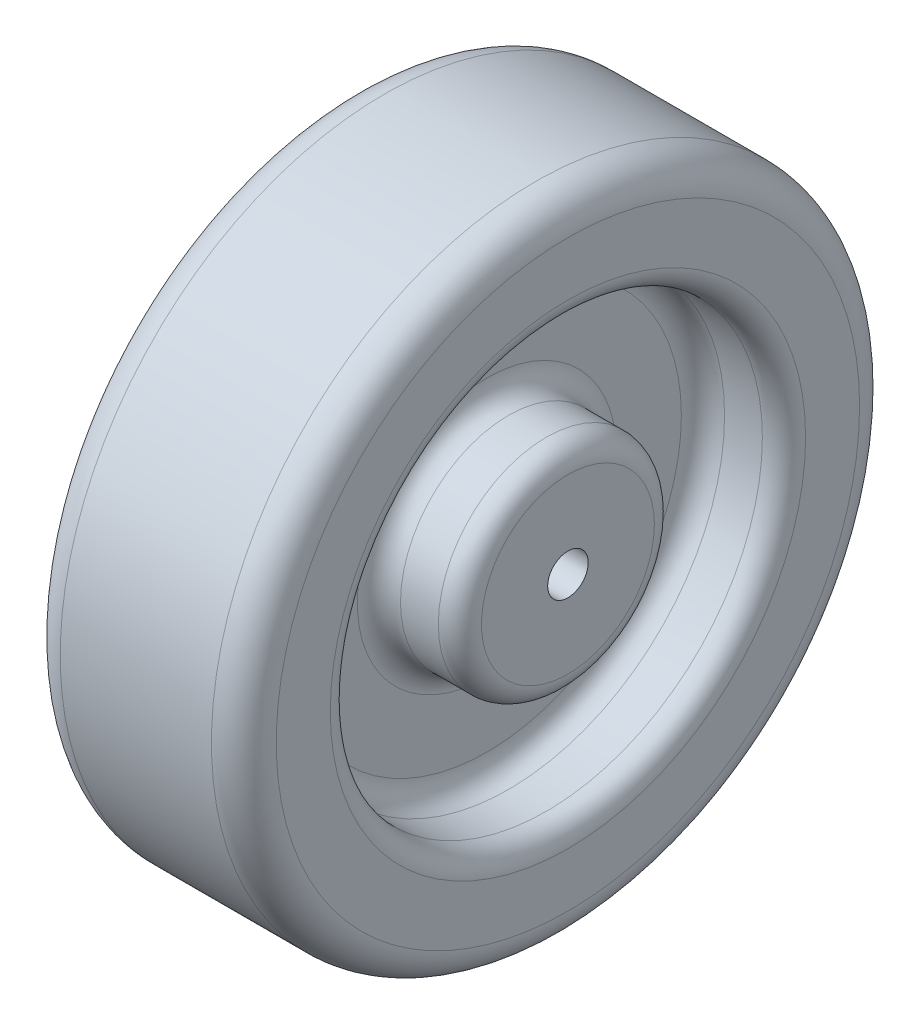
ISO-10303-21;
HEADER;
FILE_DESCRIPTION(('STEP AP214'),'2;1');
FILE_NAME('part.step','',(''),(''),'','','');
FILE_SCHEMA(('AUTOMOTIVE_DESIGN { 1 0 10303 214 1 1 1 1 }'));
ENDSEC;
DATA;
#1=APPLICATION_CONTEXT('core data for automotive mechanical design processes');
#2=APPLICATION_PROTOCOL_DEFINITION('international standard','automotive_design',2000,#1);
#3=PRODUCT_CONTEXT('',#1,'mechanical');
#4=PRODUCT('Part','Part','',(#3));
#5=PRODUCT_RELATED_PRODUCT_CATEGORY('part','',(#4));
#6=PRODUCT_DEFINITION_FORMATION('','',#4);
#7=PRODUCT_DEFINITION_CONTEXT('part definition',#1,'design');
#8=PRODUCT_DEFINITION('design','',#6,#7);
#9=PRODUCT_DEFINITION_SHAPE('','',#8);
#10=(LENGTH_UNIT() NAMED_UNIT(*) SI_UNIT(.MILLI.,.METRE.));
#11=(NAMED_UNIT(*) PLANE_ANGLE_UNIT() SI_UNIT($,.RADIAN.));
#12=(NAMED_UNIT(*) SI_UNIT($,.STERADIAN.) SOLID_ANGLE_UNIT());
#13=UNCERTAINTY_MEASURE_WITH_UNIT(LENGTH_MEASURE(1.E-05),#10,'distance_accuracy_value','');
#14=(GEOMETRIC_REPRESENTATION_CONTEXT(3) GLOBAL_UNCERTAINTY_ASSIGNED_CONTEXT((#13)) GLOBAL_UNIT_ASSIGNED_CONTEXT((#10,
#11,#12)) REPRESENTATION_CONTEXT('',''));
#15=CARTESIAN_POINT('',(0.,0.,0.));
#16=DIRECTION('',(0.,0.,1.));
#17=DIRECTION('',(1.,0.,0.));
#18=AXIS2_PLACEMENT_3D('',#15,#16,#17);
#19=CARTESIAN_POINT('',(50.8,0.,0.));
#20=DIRECTION('',(-1.,0.,0.));
#21=DIRECTION('',(0.,0.,1.));
#22=AXIS2_PLACEMENT_3D('',#19,#20,#21);
#23=CYLINDRICAL_SURFACE('',#22,76.2);
#24=CARTESIAN_POINT('',(7.62,0.,0.));
#25=DIRECTION('',(1.,0.,0.));
#26=DIRECTION('',(0.,0.,-1.));
#27=AXIS2_PLACEMENT_3D('',#24,#25,#26);
#28=CIRCLE('',#27,76.2);
#29=CARTESIAN_POINT('',(7.62,0.,-76.2));
#30=VERTEX_POINT('',#29);
#31=EDGE_CURVE('E95',#30,#30,#28,.T.);
#32=ORIENTED_EDGE('',*,*,#31,.T.);
#33=EDGE_LOOP('',(#32));
#34=FACE_BOUND('',#33,.T.);
#35=CARTESIAN_POINT('',(43.18,0.,0.));
#36=DIRECTION('',(1.,0.,0.));
#37=DIRECTION('',(0.,0.,-1.));
#38=AXIS2_PLACEMENT_3D('',#35,#36,#37);
#39=CIRCLE('',#38,76.2);
#40=CARTESIAN_POINT('',(43.18,0.,-76.2));
#41=VERTEX_POINT('',#40);
#42=EDGE_CURVE('E98',#41,#41,#39,.F.);
#43=ORIENTED_EDGE('',*,*,#42,.T.);
#44=EDGE_LOOP('',(#43));
#45=FACE_BOUND('',#44,.T.);
#46=ADVANCED_FACE('F33',(#34,#45),#23,.T.);
#47=CARTESIAN_POINT('',(50.8,0.,0.));
#48=DIRECTION('',(1.,0.,0.));
#49=DIRECTION('',(0.,0.,-1.));
#50=AXIS2_PLACEMENT_3D('',#47,#48,#49);
#51=PLANE('',#50);
#52=CARTESIAN_POINT('',(50.8,0.,0.));
#53=DIRECTION('',(1.,0.,0.));
#54=DIRECTION('',(0.,0.,-1.));
#55=AXIS2_PLACEMENT_3D('',#52,#53,#54);
#56=CIRCLE('',#55,55.88);
#57=CARTESIAN_POINT('',(50.8,0.,-55.88));
#58=VERTEX_POINT('',#57);
#59=EDGE_CURVE('E40',#58,#58,#56,.F.);
#60=ORIENTED_EDGE('',*,*,#59,.T.);
#61=EDGE_LOOP('',(#60));
#62=FACE_BOUND('',#61,.T.);
#63=CARTESIAN_POINT('',(50.8,0.,0.));
#64=DIRECTION('',(1.,0.,0.));
#65=DIRECTION('',(0.,0.,-1.));
#66=AXIS2_PLACEMENT_3D('',#63,#64,#65);
#67=CIRCLE('',#66,68.58);
#68=CARTESIAN_POINT('',(50.8,0.,-68.58));
#69=VERTEX_POINT('',#68);
#70=EDGE_CURVE('E89',#69,#69,#67,.T.);
#71=ORIENTED_EDGE('',*,*,#70,.T.);
#72=EDGE_LOOP('',(#71));
#73=FACE_BOUND('',#72,.T.);
#74=ADVANCED_FACE('F133',(#62,#73),#51,.T.);
#75=CARTESIAN_POINT('',(0.,0.,0.));
#76=DIRECTION('',(1.,0.,0.));
#77=DIRECTION('',(0.,0.,-1.));
#78=AXIS2_PLACEMENT_3D('',#75,#76,#77);
#79=PLANE('',#78);
#80=CARTESIAN_POINT('',(0.,0.,0.));
#81=DIRECTION('',(1.,0.,0.));
#82=DIRECTION('',(0.,0.,-1.));
#83=AXIS2_PLACEMENT_3D('',#80,#81,#82);
#84=CIRCLE('',#83,55.88);
#85=CARTESIAN_POINT('',(0.,0.,-55.88));
#86=VERTEX_POINT('',#85);
#87=EDGE_CURVE('E68',#86,#86,#84,.T.);
#88=ORIENTED_EDGE('',*,*,#87,.T.);
#89=EDGE_LOOP('',(#88));
#90=FACE_BOUND('',#89,.T.);
#91=CARTESIAN_POINT('',(0.,0.,0.));
#92=DIRECTION('',(1.,0.,0.));
#93=DIRECTION('',(0.,0.,-1.));
#94=AXIS2_PLACEMENT_3D('',#91,#92,#93);
#95=CIRCLE('',#94,68.58);
#96=CARTESIAN_POINT('',(0.,0.,-68.58));
#97=VERTEX_POINT('',#96);
#98=EDGE_CURVE('E92',#97,#97,#95,.F.);
#99=ORIENTED_EDGE('',*,*,#98,.T.);
#100=EDGE_LOOP('',(#99));
#101=FACE_BOUND('',#100,.T.);
#102=ADVANCED_FACE('F122',(#90,#101),#79,.F.);
#103=CARTESIAN_POINT('',(31.75,0.,0.));
#104=DIRECTION('',(1.,0.,0.));
#105=DIRECTION('',(0.,0.,-1.));
#106=AXIS2_PLACEMENT_3D('',#103,#104,#105);
#107=CYLINDRICAL_SURFACE('',#106,50.8);
#108=CARTESIAN_POINT('',(36.83,0.,0.));
#109=DIRECTION('',(1.,0.,0.));
#110=DIRECTION('',(0.,0.,-1.));
#111=AXIS2_PLACEMENT_3D('',#108,#109,#110);
#112=CIRCLE('',#111,50.8);
#113=CARTESIAN_POINT('',(36.83,0.,-50.8));
#114=VERTEX_POINT('',#113);
#115=EDGE_CURVE('E44',#114,#114,#112,.F.);
#116=ORIENTED_EDGE('',*,*,#115,.T.);
#117=EDGE_LOOP('',(#116));
#118=FACE_BOUND('',#117,.T.);
#119=CARTESIAN_POINT('',(45.72,0.,0.));
#120=DIRECTION('',(1.,0.,0.));
#121=DIRECTION('',(0.,0.,-1.));
#122=AXIS2_PLACEMENT_3D('',#119,#120,#121);
#123=CIRCLE('',#122,50.8);
#124=CARTESIAN_POINT('',(45.72,0.,-50.8));
#125=VERTEX_POINT('',#124);
#126=EDGE_CURVE('E48',#125,#125,#123,.T.);
#127=ORIENTED_EDGE('',*,*,#126,.T.);
#128=EDGE_LOOP('',(#127));
#129=FACE_BOUND('',#128,.T.);
#130=ADVANCED_FACE('F132',(#118,#129),#107,.F.);
#131=CARTESIAN_POINT('',(31.75,0.,0.));
#132=DIRECTION('',(1.,0.,0.));
#133=DIRECTION('',(0.,0.,-1.));
#134=AXIS2_PLACEMENT_3D('',#131,#132,#133);
#135=PLANE('',#134);
#136=CARTESIAN_POINT('',(31.75,0.,0.));
#137=DIRECTION('',(1.,0.,0.));
#138=DIRECTION('',(0.,0.,-1.));
#139=AXIS2_PLACEMENT_3D('',#136,#137,#138);
#140=CIRCLE('',#139,30.48);
#141=CARTESIAN_POINT('',(31.75,0.,-30.48));
#142=VERTEX_POINT('',#141);
#143=EDGE_CURVE('E53',#142,#142,#140,.F.);
#144=ORIENTED_EDGE('',*,*,#143,.T.);
#145=EDGE_LOOP('',(#144));
#146=FACE_BOUND('',#145,.T.);
#147=CARTESIAN_POINT('',(31.75,0.,0.));
#148=DIRECTION('',(1.,0.,0.));
#149=DIRECTION('',(0.,0.,-1.));
#150=AXIS2_PLACEMENT_3D('',#147,#148,#149);
#151=CIRCLE('',#150,45.72);
#152=CARTESIAN_POINT('',(31.75,0.,-45.72));
#153=VERTEX_POINT('',#152);
#154=EDGE_CURVE('E56',#153,#153,#151,.T.);
#155=ORIENTED_EDGE('',*,*,#154,.T.);
#156=EDGE_LOOP('',(#155));
#157=FACE_BOUND('',#156,.T.);
#158=ADVANCED_FACE('F183',(#146,#157),#135,.T.);
#159=CARTESIAN_POINT('',(31.75,0.,0.));
#160=DIRECTION('',(1.,0.,0.));
#161=DIRECTION('',(0.,0.,-1.));
#162=AXIS2_PLACEMENT_3D('',#159,#160,#161);
#163=CYLINDRICAL_SURFACE('',#162,25.4);
#164=CARTESIAN_POINT('',(36.83,0.,0.));
#165=DIRECTION('',(1.,0.,0.));
#166=DIRECTION('',(0.,0.,-1.));
#167=AXIS2_PLACEMENT_3D('',#164,#165,#166);
#168=CIRCLE('',#167,25.4);
#169=CARTESIAN_POINT('',(36.83,0.,-25.4));
#170=VERTEX_POINT('',#169);
#171=EDGE_CURVE('E59',#170,#170,#168,.T.);
#172=ORIENTED_EDGE('',*,*,#171,.T.);
#173=EDGE_LOOP('',(#172));
#174=FACE_BOUND('',#173,.T.);
#175=CARTESIAN_POINT('',(45.72,0.,0.));
#176=DIRECTION('',(1.,0.,0.));
#177=DIRECTION('',(0.,0.,-1.));
#178=AXIS2_PLACEMENT_3D('',#175,#176,#177);
#179=CIRCLE('',#178,25.4);
#180=CARTESIAN_POINT('',(45.72,0.,-25.4));
#181=VERTEX_POINT('',#180);
#182=EDGE_CURVE('E62',#181,#181,#179,.F.);
#183=ORIENTED_EDGE('',*,*,#182,.T.);
#184=EDGE_LOOP('',(#183));
#185=FACE_BOUND('',#184,.T.);
#186=ADVANCED_FACE('F189',(#174,#185),#163,.T.);
#187=CARTESIAN_POINT('',(50.8,0.,0.));
#188=DIRECTION('',(1.,0.,0.));
#189=DIRECTION('',(0.,0.,-1.));
#190=AXIS2_PLACEMENT_3D('',#187,#188,#189);
#191=CIRCLE('',#190,20.32);
#192=CARTESIAN_POINT('',(50.8,0.,-20.32));
#193=VERTEX_POINT('',#192);
#194=EDGE_CURVE('E10',#193,#193,#191,.T.);
#195=ORIENTED_EDGE('',*,*,#194,.T.);
#196=EDGE_LOOP('',(#195));
#197=FACE_BOUND('',#196,.T.);
#198=CARTESIAN_POINT('',(50.8,0.,0.));
#199=DIRECTION('',(-1.,0.,0.));
#200=DIRECTION('',(0.,0.,1.));
#201=AXIS2_PLACEMENT_3D('',#198,#199,#200);
#202=CIRCLE('',#201,4.7625);
#203=CARTESIAN_POINT('',(50.8,0.,4.7625));
#204=VERTEX_POINT('',#203);
#205=EDGE_CURVE('E101',#204,#204,#202,.T.);
#206=ORIENTED_EDGE('',*,*,#205,.T.);
#207=EDGE_LOOP('',(#206));
#208=FACE_BOUND('',#207,.T.);
#209=ADVANCED_FACE('F108',(#197,#208),#51,.T.);
#210=CARTESIAN_POINT('',(19.05,0.,0.));
#211=DIRECTION('',(-1.,0.,0.));
#212=DIRECTION('',(0.,0.,1.));
#213=AXIS2_PLACEMENT_3D('',#210,#211,#212);
#214=CYLINDRICAL_SURFACE('',#213,50.8);
#215=CARTESIAN_POINT('',(5.08,0.,0.));
#216=DIRECTION('',(1.,0.,0.));
#217=DIRECTION('',(0.,0.,-1.));
#218=AXIS2_PLACEMENT_3D('',#215,#216,#217);
#219=CIRCLE('',#218,50.8);
#220=CARTESIAN_POINT('',(5.08,0.,-50.8));
#221=VERTEX_POINT('',#220);
#222=EDGE_CURVE('E71',#221,#221,#219,.F.);
#223=ORIENTED_EDGE('',*,*,#222,.T.);
#224=EDGE_LOOP('',(#223));
#225=FACE_BOUND('',#224,.T.);
#226=CARTESIAN_POINT('',(13.97,0.,0.));
#227=DIRECTION('',(-1.,0.,0.));
#228=DIRECTION('',(0.,0.,1.));
#229=AXIS2_PLACEMENT_3D('',#226,#227,#228);
#230=CIRCLE('',#229,50.8);
#231=CARTESIAN_POINT('',(13.97,0.,50.8));
#232=VERTEX_POINT('',#231);
#233=EDGE_CURVE('E74',#232,#232,#230,.F.);
#234=ORIENTED_EDGE('',*,*,#233,.T.);
#235=EDGE_LOOP('',(#234));
#236=FACE_BOUND('',#235,.T.);
#237=ADVANCED_FACE('F196',(#225,#236),#214,.F.);
#238=CARTESIAN_POINT('',(19.05,0.,0.));
#239=DIRECTION('',(-1.,0.,0.));
#240=DIRECTION('',(0.,0.,1.));
#241=AXIS2_PLACEMENT_3D('',#238,#239,#240);
#242=PLANE('',#241);
#243=CARTESIAN_POINT('',(19.05,0.,0.));
#244=DIRECTION('',(-1.,0.,0.));
#245=DIRECTION('',(0.,0.,1.));
#246=AXIS2_PLACEMENT_3D('',#243,#244,#245);
#247=CIRCLE('',#246,30.48);
#248=CARTESIAN_POINT('',(19.05,0.,30.48));
#249=VERTEX_POINT('',#248);
#250=EDGE_CURVE('E77',#249,#249,#247,.F.);
#251=ORIENTED_EDGE('',*,*,#250,.T.);
#252=EDGE_LOOP('',(#251));
#253=FACE_BOUND('',#252,.T.);
#254=CARTESIAN_POINT('',(19.05,0.,0.));
#255=DIRECTION('',(-1.,0.,0.));
#256=DIRECTION('',(0.,0.,1.));
#257=AXIS2_PLACEMENT_3D('',#254,#255,#256);
#258=CIRCLE('',#257,45.72);
#259=CARTESIAN_POINT('',(19.05,0.,45.72));
#260=VERTEX_POINT('',#259);
#261=EDGE_CURVE('E80',#260,#260,#258,.T.);
#262=ORIENTED_EDGE('',*,*,#261,.T.);
#263=EDGE_LOOP('',(#262));
#264=FACE_BOUND('',#263,.T.);
#265=ADVANCED_FACE('F126',(#253,#264),#242,.T.);
#266=CARTESIAN_POINT('',(19.05,0.,0.));
#267=DIRECTION('',(-1.,0.,0.));
#268=DIRECTION('',(0.,0.,1.));
#269=AXIS2_PLACEMENT_3D('',#266,#267,#268);
#270=CYLINDRICAL_SURFACE('',#269,25.4);
#271=CARTESIAN_POINT('',(13.97,0.,0.));
#272=DIRECTION('',(-1.,0.,0.));
#273=DIRECTION('',(0.,0.,1.));
#274=AXIS2_PLACEMENT_3D('',#271,#272,#273);
#275=CIRCLE('',#274,25.4);
#276=CARTESIAN_POINT('',(13.97,0.,25.4));
#277=VERTEX_POINT('',#276);
#278=EDGE_CURVE('E83',#277,#277,#275,.T.);
#279=ORIENTED_EDGE('',*,*,#278,.T.);
#280=EDGE_LOOP('',(#279));
#281=FACE_BOUND('',#280,.T.);
#282=CARTESIAN_POINT('',(5.08,0.,0.));
#283=DIRECTION('',(1.,0.,0.));
#284=DIRECTION('',(0.,0.,-1.));
#285=AXIS2_PLACEMENT_3D('',#282,#283,#284);
#286=CIRCLE('',#285,25.4);
#287=CARTESIAN_POINT('',(5.08,0.,-25.4));
#288=VERTEX_POINT('',#287);
#289=EDGE_CURVE('E86',#288,#288,#286,.T.);
#290=ORIENTED_EDGE('',*,*,#289,.T.);
#291=EDGE_LOOP('',(#290));
#292=FACE_BOUND('',#291,.T.);
#293=ADVANCED_FACE('F119',(#281,#292),#270,.T.);
#294=CARTESIAN_POINT('',(0.,0.,0.));
#295=DIRECTION('',(1.,0.,0.));
#296=DIRECTION('',(0.,0.,-1.));
#297=AXIS2_PLACEMENT_3D('',#294,#295,#296);
#298=CIRCLE('',#297,20.32);
#299=CARTESIAN_POINT('',(0.,0.,-20.32));
#300=VERTEX_POINT('',#299);
#301=EDGE_CURVE('E65',#300,#300,#298,.F.);
#302=ORIENTED_EDGE('',*,*,#301,.T.);
#303=EDGE_LOOP('',(#302));
#304=FACE_BOUND('',#303,.T.);
#305=CARTESIAN_POINT('',(0.,0.,0.));
#306=DIRECTION('',(-1.,0.,0.));
#307=DIRECTION('',(0.,0.,1.));
#308=AXIS2_PLACEMENT_3D('',#305,#306,#307);
#309=CIRCLE('',#308,4.7625);
#310=CARTESIAN_POINT('',(0.,0.,4.7625));
#311=VERTEX_POINT('',#310);
#312=EDGE_CURVE('E102',#311,#311,#309,.T.);
#313=ORIENTED_EDGE('',*,*,#312,.F.);
#314=EDGE_LOOP('',(#313));
#315=FACE_BOUND('',#314,.T.);
#316=ADVANCED_FACE('F114',(#304,#315),#79,.F.);
#317=CARTESIAN_POINT('',(50.8,0.,0.));
#318=DIRECTION('',(-1.,0.,0.));
#319=DIRECTION('',(0.,0.,1.));
#320=AXIS2_PLACEMENT_3D('',#317,#318,#319);
#321=CYLINDRICAL_SURFACE('',#320,4.7625);
#322=ORIENTED_EDGE('',*,*,#205,.F.);
#323=EDGE_LOOP('',(#322));
#324=FACE_BOUND('',#323,.T.);
#325=ORIENTED_EDGE('',*,*,#312,.T.);
#326=EDGE_LOOP('',(#325));
#327=FACE_BOUND('',#326,.T.);
#328=ADVANCED_FACE('F110',(#324,#327),#321,.F.);
#329=CARTESIAN_POINT('',(7.62,0.,0.));
#330=DIRECTION('',(1.,0.,0.));
#331=DIRECTION('',(0.,0.,-1.));
#332=AXIS2_PLACEMENT_3D('',#329,#330,#331);
#333=TOROIDAL_SURFACE('',#332,68.58,7.62);
#334=ORIENTED_EDGE('',*,*,#98,.F.);
#335=EDGE_LOOP('',(#334));
#336=FACE_BOUND('',#335,.T.);
#337=ORIENTED_EDGE('',*,*,#31,.F.);
#338=EDGE_LOOP('',(#337));
#339=FACE_BOUND('',#338,.T.);
#340=ADVANCED_FACE('F113',(#336,#339),#333,.T.);
#341=CARTESIAN_POINT('',(43.18,0.,0.));
#342=DIRECTION('',(1.,0.,0.));
#343=DIRECTION('',(0.,0.,-1.));
#344=AXIS2_PLACEMENT_3D('',#341,#342,#343);
#345=TOROIDAL_SURFACE('',#344,68.58,7.62);
#346=ORIENTED_EDGE('',*,*,#42,.F.);
#347=EDGE_LOOP('',(#346));
#348=FACE_BOUND('',#347,.T.);
#349=ORIENTED_EDGE('',*,*,#70,.F.);
#350=EDGE_LOOP('',(#349));
#351=FACE_BOUND('',#350,.T.);
#352=ADVANCED_FACE('F144',(#348,#351),#345,.T.);
#353=CARTESIAN_POINT('',(13.97,0.,0.));
#354=DIRECTION('',(-1.,0.,0.));
#355=DIRECTION('',(0.,0.,1.));
#356=AXIS2_PLACEMENT_3D('',#353,#354,#355);
#357=TOROIDAL_SURFACE('',#356,30.48,5.08);
#358=ORIENTED_EDGE('',*,*,#250,.F.);
#359=EDGE_LOOP('',(#358));
#360=FACE_BOUND('',#359,.T.);
#361=ORIENTED_EDGE('',*,*,#278,.F.);
#362=EDGE_LOOP('',(#361));
#363=FACE_BOUND('',#362,.T.);
#364=ADVANCED_FACE('F148',(#360,#363),#357,.F.);
#365=CARTESIAN_POINT('',(5.08,0.,0.));
#366=DIRECTION('',(1.,0.,0.));
#367=DIRECTION('',(0.,0.,-1.));
#368=AXIS2_PLACEMENT_3D('',#365,#366,#367);
#369=TOROIDAL_SURFACE('',#368,55.88,5.08);
#370=ORIENTED_EDGE('',*,*,#87,.F.);
#371=EDGE_LOOP('',(#370));
#372=FACE_BOUND('',#371,.T.);
#373=ORIENTED_EDGE('',*,*,#222,.F.);
#374=EDGE_LOOP('',(#373));
#375=FACE_BOUND('',#374,.T.);
#376=ADVANCED_FACE('F152',(#372,#375),#369,.T.);
#377=CARTESIAN_POINT('',(13.97,0.,0.));
#378=DIRECTION('',(-1.,0.,0.));
#379=DIRECTION('',(0.,0.,1.));
#380=AXIS2_PLACEMENT_3D('',#377,#378,#379);
#381=TOROIDAL_SURFACE('',#380,45.72,5.08);
#382=ORIENTED_EDGE('',*,*,#233,.F.);
#383=EDGE_LOOP('',(#382));
#384=FACE_BOUND('',#383,.T.);
#385=ORIENTED_EDGE('',*,*,#261,.F.);
#386=EDGE_LOOP('',(#385));
#387=FACE_BOUND('',#386,.T.);
#388=ADVANCED_FACE('F156',(#384,#387),#381,.F.);
#389=CARTESIAN_POINT('',(5.08,0.,0.));
#390=DIRECTION('',(1.,0.,0.));
#391=DIRECTION('',(0.,0.,-1.));
#392=AXIS2_PLACEMENT_3D('',#389,#390,#391);
#393=TOROIDAL_SURFACE('',#392,20.32,5.08);
#394=ORIENTED_EDGE('',*,*,#289,.F.);
#395=EDGE_LOOP('',(#394));
#396=FACE_BOUND('',#395,.T.);
#397=ORIENTED_EDGE('',*,*,#301,.F.);
#398=EDGE_LOOP('',(#397));
#399=FACE_BOUND('',#398,.T.);
#400=ADVANCED_FACE('F160',(#396,#399),#393,.T.);
#401=CARTESIAN_POINT('',(36.83,0.,0.));
#402=DIRECTION('',(1.,0.,0.));
#403=DIRECTION('',(0.,0.,-1.));
#404=AXIS2_PLACEMENT_3D('',#401,#402,#403);
#405=TOROIDAL_SURFACE('',#404,30.48,5.08);
#406=ORIENTED_EDGE('',*,*,#143,.F.);
#407=EDGE_LOOP('',(#406));
#408=FACE_BOUND('',#407,.T.);
#409=ORIENTED_EDGE('',*,*,#171,.F.);
#410=EDGE_LOOP('',(#409));
#411=FACE_BOUND('',#410,.T.);
#412=ADVANCED_FACE('F164',(#408,#411),#405,.F.);
#413=CARTESIAN_POINT('',(36.83,0.,0.));
#414=DIRECTION('',(1.,0.,0.));
#415=DIRECTION('',(0.,0.,-1.));
#416=AXIS2_PLACEMENT_3D('',#413,#414,#415);
#417=TOROIDAL_SURFACE('',#416,45.72,5.08);
#418=ORIENTED_EDGE('',*,*,#115,.F.);
#419=EDGE_LOOP('',(#418));
#420=FACE_BOUND('',#419,.T.);
#421=ORIENTED_EDGE('',*,*,#154,.F.);
#422=EDGE_LOOP('',(#421));
#423=FACE_BOUND('',#422,.T.);
#424=ADVANCED_FACE('F168',(#420,#423),#417,.F.);
#425=CARTESIAN_POINT('',(45.72,0.,0.));
#426=DIRECTION('',(1.,0.,0.));
#427=DIRECTION('',(0.,0.,-1.));
#428=AXIS2_PLACEMENT_3D('',#425,#426,#427);
#429=TOROIDAL_SURFACE('',#428,55.88,5.08);
#430=ORIENTED_EDGE('',*,*,#59,.F.);
#431=EDGE_LOOP('',(#430));
#432=FACE_BOUND('',#431,.T.);
#433=ORIENTED_EDGE('',*,*,#126,.F.);
#434=EDGE_LOOP('',(#433));
#435=FACE_BOUND('',#434,.T.);
#436=ADVANCED_FACE('F171',(#432,#435),#429,.T.);
#437=CARTESIAN_POINT('',(45.72,0.,0.));
#438=DIRECTION('',(1.,0.,0.));
#439=DIRECTION('',(0.,0.,-1.));
#440=AXIS2_PLACEMENT_3D('',#437,#438,#439);
#441=TOROIDAL_SURFACE('',#440,20.32,5.08);
#442=ORIENTED_EDGE('',*,*,#182,.F.);
#443=EDGE_LOOP('',(#442));
#444=FACE_BOUND('',#443,.T.);
#445=ORIENTED_EDGE('',*,*,#194,.F.);
#446=EDGE_LOOP('',(#445));
#447=FACE_BOUND('',#446,.T.);
#448=ADVANCED_FACE('F35',(#444,#447),#441,.T.);
#449=CLOSED_SHELL('',(#46,#74,#102,#130,#158,#186,#209,#237,#265,#293,#316,#328,#340,#352,#364,
#376,#388,#400,#412,#424,#436,#448));
#450=MANIFOLD_SOLID_BREP('B2',#449);
#451=ADVANCED_BREP_SHAPE_REPRESENTATION('',(#18,#450),#14);
#452=SHAPE_DEFINITION_REPRESENTATION(#9,#451);
ENDSEC;
END-ISO-10303-21;
